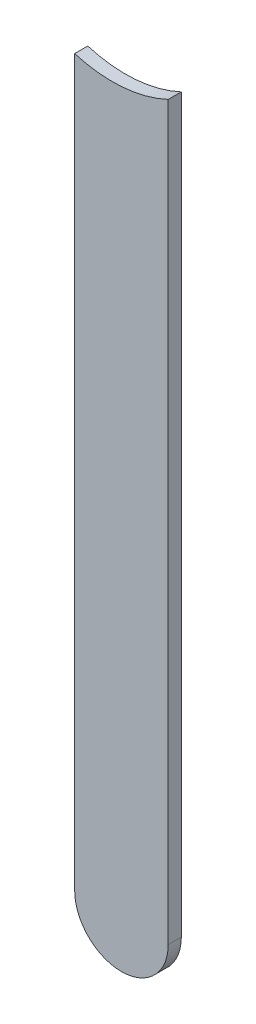
ISO-10303-21;
HEADER;
FILE_DESCRIPTION(('STEP AP214'),'2;1');
FILE_NAME('part.step','',(''),(''),'','','');
FILE_SCHEMA(('AUTOMOTIVE_DESIGN { 1 0 10303 214 1 1 1 1 }'));
ENDSEC;
DATA;
#1=APPLICATION_CONTEXT('core data for automotive mechanical design processes');
#2=APPLICATION_PROTOCOL_DEFINITION('international standard','automotive_design',2000,#1);
#3=PRODUCT_CONTEXT('',#1,'mechanical');
#4=PRODUCT('Part','Part','',(#3));
#5=PRODUCT_RELATED_PRODUCT_CATEGORY('part','',(#4));
#6=PRODUCT_DEFINITION_FORMATION('','',#4);
#7=PRODUCT_DEFINITION_CONTEXT('part definition',#1,'design');
#8=PRODUCT_DEFINITION('design','',#6,#7);
#9=PRODUCT_DEFINITION_SHAPE('','',#8);
#10=(LENGTH_UNIT() NAMED_UNIT(*) SI_UNIT(.MILLI.,.METRE.));
#11=(NAMED_UNIT(*) PLANE_ANGLE_UNIT() SI_UNIT($,.RADIAN.));
#12=(NAMED_UNIT(*) SI_UNIT($,.STERADIAN.) SOLID_ANGLE_UNIT());
#13=UNCERTAINTY_MEASURE_WITH_UNIT(LENGTH_MEASURE(1.E-05),#10,'distance_accuracy_value','');
#14=(GEOMETRIC_REPRESENTATION_CONTEXT(3) GLOBAL_UNCERTAINTY_ASSIGNED_CONTEXT((#13)) GLOBAL_UNIT_ASSIGNED_CONTEXT((#10,
#11,#12)) REPRESENTATION_CONTEXT('',''));
#15=CARTESIAN_POINT('',(0.,0.,0.));
#16=DIRECTION('',(0.,0.,1.));
#17=DIRECTION('',(1.,0.,0.));
#18=AXIS2_PLACEMENT_3D('',#15,#16,#17);
#19=CARTESIAN_POINT('',(94.6689496,52.8780248,0.));
#20=DIRECTION('',(-1.,0.,0.));
#21=DIRECTION('',(0.,1.,0.));
#22=AXIS2_PLACEMENT_3D('',#19,#20,#21);
#23=PLANE('',#22);
#24=DIRECTION('',(0.,1.,0.));
#25=VECTOR('',#24,1.);
#26=CARTESIAN_POINT('',(94.6689496,52.8780248,0.03556));
#27=LINE('',#26,#25);
#28=CARTESIAN_POINT('',(94.6689496,52.8780248,0.03556));
#29=VERTEX_POINT('',#28);
#30=CARTESIAN_POINT('',(94.6689496,54.8654854262864,0.03556));
#31=VERTEX_POINT('',#30);
#32=EDGE_CURVE('E11',#29,#31,#27,.T.);
#33=ORIENTED_EDGE('',*,*,#32,.F.);
#34=DIRECTION('',(0.,0.,1.));
#35=VECTOR('',#34,1.);
#36=CARTESIAN_POINT('',(94.6689496,52.8780248,0.));
#37=LINE('',#36,#35);
#38=CARTESIAN_POINT('',(94.6689496,52.8780248,0.));
#39=VERTEX_POINT('',#38);
#40=EDGE_CURVE('E24',#39,#29,#37,.T.);
#41=ORIENTED_EDGE('',*,*,#40,.F.);
#42=DIRECTION('',(0.,1.,0.));
#43=VECTOR('',#42,1.);
#44=CARTESIAN_POINT('',(94.6689496,52.8780248,0.));
#45=LINE('',#44,#43);
#46=CARTESIAN_POINT('',(94.6689496,54.8654854262864,0.));
#47=VERTEX_POINT('',#46);
#48=EDGE_CURVE('E75',#39,#47,#45,.T.);
#49=ORIENTED_EDGE('',*,*,#48,.T.);
#50=DIRECTION('',(0.,0.,1.));
#51=VECTOR('',#50,1.);
#52=CARTESIAN_POINT('',(94.6689496,54.8654854262864,0.));
#53=LINE('',#52,#51);
#54=EDGE_CURVE('E37',#47,#31,#53,.T.);
#55=ORIENTED_EDGE('',*,*,#54,.T.);
#56=EDGE_LOOP('',(#33,#41,#49,#55));
#57=FACE_BOUND('',#56,.T.);
#58=ADVANCED_FACE('F17',(#57),#23,.F.);
#59=CARTESIAN_POINT('',(94.51697378,55.1869737,0.));
#60=DIRECTION('',(0.,0.,-1.));
#61=DIRECTION('',(1.,0.,0.));
#62=AXIS2_PLACEMENT_3D('',#59,#60,#61);
#63=CYLINDRICAL_SURFACE('',#62,0.3556);
#64=DIRECTION('',(0.,0.,1.));
#65=VECTOR('',#64,1.);
#66=CARTESIAN_POINT('',(94.4149496,54.8463236938422,0.));
#67=LINE('',#66,#65);
#68=CARTESIAN_POINT('',(94.4149496,54.8463236938422,0.));
#69=VERTEX_POINT('',#68);
#70=CARTESIAN_POINT('',(94.4149496,54.8463236938422,0.03556));
#71=VERTEX_POINT('',#70);
#72=EDGE_CURVE('E67',#69,#71,#67,.T.);
#73=ORIENTED_EDGE('',*,*,#72,.T.);
#74=CARTESIAN_POINT('',(94.51697378,55.1869737,0.03556));
#75=DIRECTION('',(0.,0.,1.));
#76=DIRECTION('',(1.,0.,0.));
#77=AXIS2_PLACEMENT_3D('',#74,#75,#76);
#78=CIRCLE('',#77,0.3556);
#79=EDGE_CURVE('E82',#71,#31,#78,.T.);
#80=ORIENTED_EDGE('',*,*,#79,.T.);
#81=ORIENTED_EDGE('',*,*,#54,.F.);
#82=CARTESIAN_POINT('',(94.51697378,55.1869737,0.));
#83=DIRECTION('',(0.,0.,1.));
#84=DIRECTION('',(1.,0.,0.));
#85=AXIS2_PLACEMENT_3D('',#82,#83,#84);
#86=CIRCLE('',#85,0.3556);
#87=EDGE_CURVE('E80',#69,#47,#86,.T.);
#88=ORIENTED_EDGE('',*,*,#87,.F.);
#89=EDGE_LOOP('',(#73,#80,#81,#88));
#90=FACE_BOUND('',#89,.T.);
#91=ADVANCED_FACE('F88',(#90),#63,.F.);
#92=CARTESIAN_POINT('',(94.4149496,54.8463236938422,0.));
#93=DIRECTION('',(1.,0.,0.));
#94=DIRECTION('',(0.,-1.,0.));
#95=AXIS2_PLACEMENT_3D('',#92,#93,#94);
#96=PLANE('',#95);
#97=DIRECTION('',(0.,-1.,0.));
#98=VECTOR('',#97,1.);
#99=CARTESIAN_POINT('',(94.4149496,55.16199788,0.03556));
#100=LINE('',#99,#98);
#101=CARTESIAN_POINT('',(94.4149496,52.8780248,0.03556));
#102=VERTEX_POINT('',#101);
#103=EDGE_CURVE('E71',#71,#102,#100,.T.);
#104=ORIENTED_EDGE('',*,*,#103,.F.);
#105=ORIENTED_EDGE('',*,*,#72,.F.);
#106=DIRECTION('',(0.,-1.,0.));
#107=VECTOR('',#106,1.);
#108=CARTESIAN_POINT('',(94.4149496,55.16199788,0.));
#109=LINE('',#108,#107);
#110=CARTESIAN_POINT('',(94.4149496,52.8780248,0.));
#111=VERTEX_POINT('',#110);
#112=EDGE_CURVE('E63',#69,#111,#109,.T.);
#113=ORIENTED_EDGE('',*,*,#112,.T.);
#114=DIRECTION('',(0.,0.,1.));
#115=VECTOR('',#114,1.);
#116=CARTESIAN_POINT('',(94.4149496,52.8780248,0.));
#117=LINE('',#116,#115);
#118=EDGE_CURVE('E53',#111,#102,#117,.T.);
#119=ORIENTED_EDGE('',*,*,#118,.T.);
#120=EDGE_LOOP('',(#104,#105,#113,#119));
#121=FACE_BOUND('',#120,.T.);
#122=ADVANCED_FACE('F66',(#121),#96,.F.);
#123=CARTESIAN_POINT('',(94.5419496,52.8780248,0.));
#124=DIRECTION('',(0.,0.,-1.));
#125=DIRECTION('',(-1.,0.,0.));
#126=AXIS2_PLACEMENT_3D('',#123,#124,#125);
#127=CYLINDRICAL_SURFACE('',#126,0.127000000000002);
#128=CARTESIAN_POINT('',(94.5419496,52.8780248,0.03556));
#129=DIRECTION('',(0.,0.,1.));
#130=DIRECTION('',(-1.,0.,0.));
#131=AXIS2_PLACEMENT_3D('',#128,#129,#130);
#132=CIRCLE('',#131,0.127000000000002);
#133=EDGE_CURVE('E59',#102,#29,#132,.T.);
#134=ORIENTED_EDGE('',*,*,#133,.F.);
#135=ORIENTED_EDGE('',*,*,#118,.F.);
#136=CARTESIAN_POINT('',(94.5419496,52.8780248,0.));
#137=DIRECTION('',(0.,0.,1.));
#138=DIRECTION('',(-1.,0.,0.));
#139=AXIS2_PLACEMENT_3D('',#136,#137,#138);
#140=CIRCLE('',#139,0.127000000000002);
#141=EDGE_CURVE('E57',#111,#39,#140,.T.);
#142=ORIENTED_EDGE('',*,*,#141,.T.);
#143=ORIENTED_EDGE('',*,*,#40,.T.);
#144=EDGE_LOOP('',(#134,#135,#142,#143));
#145=FACE_BOUND('',#144,.T.);
#146=ADVANCED_FACE('F55',(#145),#127,.T.);
#147=CARTESIAN_POINT('',(94.6689496,52.8780248,0.));
#148=DIRECTION('',(0.,0.,-1.));
#149=DIRECTION('',(-1.,0.,0.));
#150=AXIS2_PLACEMENT_3D('',#147,#148,#149);
#151=PLANE('',#150);
#152=ORIENTED_EDGE('',*,*,#48,.F.);
#153=ORIENTED_EDGE('',*,*,#141,.F.);
#154=ORIENTED_EDGE('',*,*,#112,.F.);
#155=ORIENTED_EDGE('',*,*,#87,.T.);
#156=EDGE_LOOP('',(#152,#153,#154,#155));
#157=FACE_BOUND('',#156,.T.);
#158=ADVANCED_FACE('F74',(#157),#151,.T.);
#159=CARTESIAN_POINT('',(94.6689496,52.8780248,0.03556));
#160=DIRECTION('',(0.,0.,-1.));
#161=DIRECTION('',(-1.,0.,0.));
#162=AXIS2_PLACEMENT_3D('',#159,#160,#161);
#163=PLANE('',#162);
#164=ORIENTED_EDGE('',*,*,#133,.T.);
#165=ORIENTED_EDGE('',*,*,#32,.T.);
#166=ORIENTED_EDGE('',*,*,#79,.F.);
#167=ORIENTED_EDGE('',*,*,#103,.T.);
#168=EDGE_LOOP('',(#164,#165,#166,#167));
#169=FACE_BOUND('',#168,.T.);
#170=ADVANCED_FACE('F91',(#169),#163,.F.);
#171=CLOSED_SHELL('',(#58,#91,#122,#146,#158,#170));
#172=MANIFOLD_SOLID_BREP('B1',#171);
#173=ADVANCED_BREP_SHAPE_REPRESENTATION('',(#18,#172),#14);
#174=SHAPE_DEFINITION_REPRESENTATION(#9,#173);
ENDSEC;
END-ISO-10303-21;
